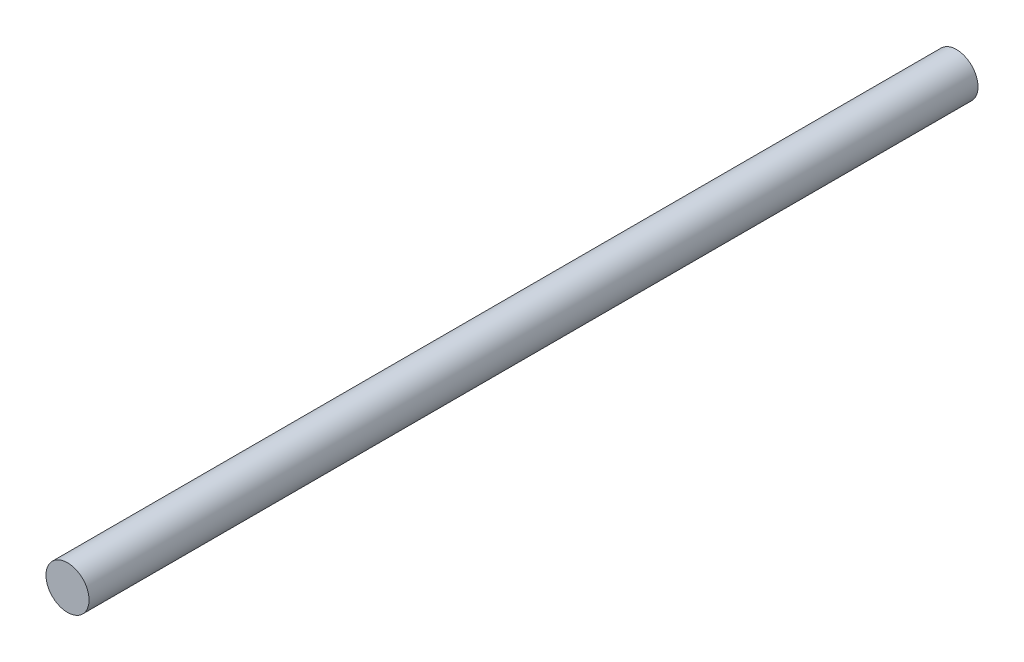
ISO-10303-21;
HEADER;
FILE_DESCRIPTION(('STEP AP214'),'2;1');
FILE_NAME('part.step','',(''),(''),'','','');
FILE_SCHEMA(('AUTOMOTIVE_DESIGN { 1 0 10303 214 1 1 1 1 }'));
ENDSEC;
DATA;
#1=APPLICATION_CONTEXT('core data for automotive mechanical design processes');
#2=APPLICATION_PROTOCOL_DEFINITION('international standard','automotive_design',2000,#1);
#3=PRODUCT_CONTEXT('',#1,'mechanical');
#4=PRODUCT('Part','Part','',(#3));
#5=PRODUCT_RELATED_PRODUCT_CATEGORY('part','',(#4));
#6=PRODUCT_DEFINITION_FORMATION('','',#4);
#7=PRODUCT_DEFINITION_CONTEXT('part definition',#1,'design');
#8=PRODUCT_DEFINITION('design','',#6,#7);
#9=PRODUCT_DEFINITION_SHAPE('','',#8);
#10=(LENGTH_UNIT() NAMED_UNIT(*) SI_UNIT(.MILLI.,.METRE.));
#11=(NAMED_UNIT(*) PLANE_ANGLE_UNIT() SI_UNIT($,.RADIAN.));
#12=(NAMED_UNIT(*) SI_UNIT($,.STERADIAN.) SOLID_ANGLE_UNIT());
#13=UNCERTAINTY_MEASURE_WITH_UNIT(LENGTH_MEASURE(1.E-05),#10,'distance_accuracy_value','');
#14=(GEOMETRIC_REPRESENTATION_CONTEXT(3) GLOBAL_UNCERTAINTY_ASSIGNED_CONTEXT((#13)) GLOBAL_UNIT_ASSIGNED_CONTEXT((#10,
#11,#12)) REPRESENTATION_CONTEXT('',''));
#15=CARTESIAN_POINT('',(0.,0.,0.));
#16=DIRECTION('',(0.,0.,1.));
#17=DIRECTION('',(1.,0.,0.));
#18=AXIS2_PLACEMENT_3D('',#15,#16,#17);
#19=CARTESIAN_POINT('',(0.,0.,-165.));
#20=DIRECTION('',(0.,0.,1.));
#21=DIRECTION('',(1.,0.,0.));
#22=AXIS2_PLACEMENT_3D('',#19,#20,#21);
#23=CYLINDRICAL_SURFACE('',#22,8.);
#24=CARTESIAN_POINT('',(0.,0.,-165.));
#25=DIRECTION('',(0.,0.,1.));
#26=DIRECTION('',(1.,0.,0.));
#27=AXIS2_PLACEMENT_3D('',#24,#25,#26);
#28=CIRCLE('',#27,8.);
#29=CARTESIAN_POINT('',(8.,0.,-165.));
#30=VERTEX_POINT('',#29);
#31=EDGE_CURVE('E10',#30,#30,#28,.T.);
#32=ORIENTED_EDGE('',*,*,#31,.T.);
#33=EDGE_LOOP('',(#32));
#34=FACE_BOUND('',#33,.T.);
#35=CARTESIAN_POINT('',(0.,0.,165.));
#36=DIRECTION('',(0.,0.,1.));
#37=DIRECTION('',(1.,0.,0.));
#38=AXIS2_PLACEMENT_3D('',#35,#36,#37);
#39=CIRCLE('',#38,8.);
#40=CARTESIAN_POINT('',(8.,0.,165.));
#41=VERTEX_POINT('',#40);
#42=EDGE_CURVE('E39',#41,#41,#39,.T.);
#43=ORIENTED_EDGE('',*,*,#42,.F.);
#44=EDGE_LOOP('',(#43));
#45=FACE_BOUND('',#44,.T.);
#46=ADVANCED_FACE('F33',(#34,#45),#23,.T.);
#47=CARTESIAN_POINT('',(0.,0.,-165.));
#48=DIRECTION('',(0.,0.,1.));
#49=DIRECTION('',(1.,0.,0.));
#50=AXIS2_PLACEMENT_3D('',#47,#48,#49);
#51=PLANE('',#50);
#52=ORIENTED_EDGE('',*,*,#31,.F.);
#53=EDGE_LOOP('',(#52));
#54=FACE_BOUND('',#53,.T.);
#55=ADVANCED_FACE('F48',(#54),#51,.F.);
#56=CARTESIAN_POINT('',(0.,0.,165.));
#57=DIRECTION('',(0.,0.,1.));
#58=DIRECTION('',(1.,0.,0.));
#59=AXIS2_PLACEMENT_3D('',#56,#57,#58);
#60=PLANE('',#59);
#61=ORIENTED_EDGE('',*,*,#42,.T.);
#62=EDGE_LOOP('',(#61));
#63=FACE_BOUND('',#62,.T.);
#64=ADVANCED_FACE('F45',(#63),#60,.T.);
#65=CLOSED_SHELL('',(#46,#55,#64));
#66=MANIFOLD_SOLID_BREP('B2',#65);
#67=ADVANCED_BREP_SHAPE_REPRESENTATION('',(#18,#66),#14);
#68=SHAPE_DEFINITION_REPRESENTATION(#9,#67);
ENDSEC;
END-ISO-10303-21;
